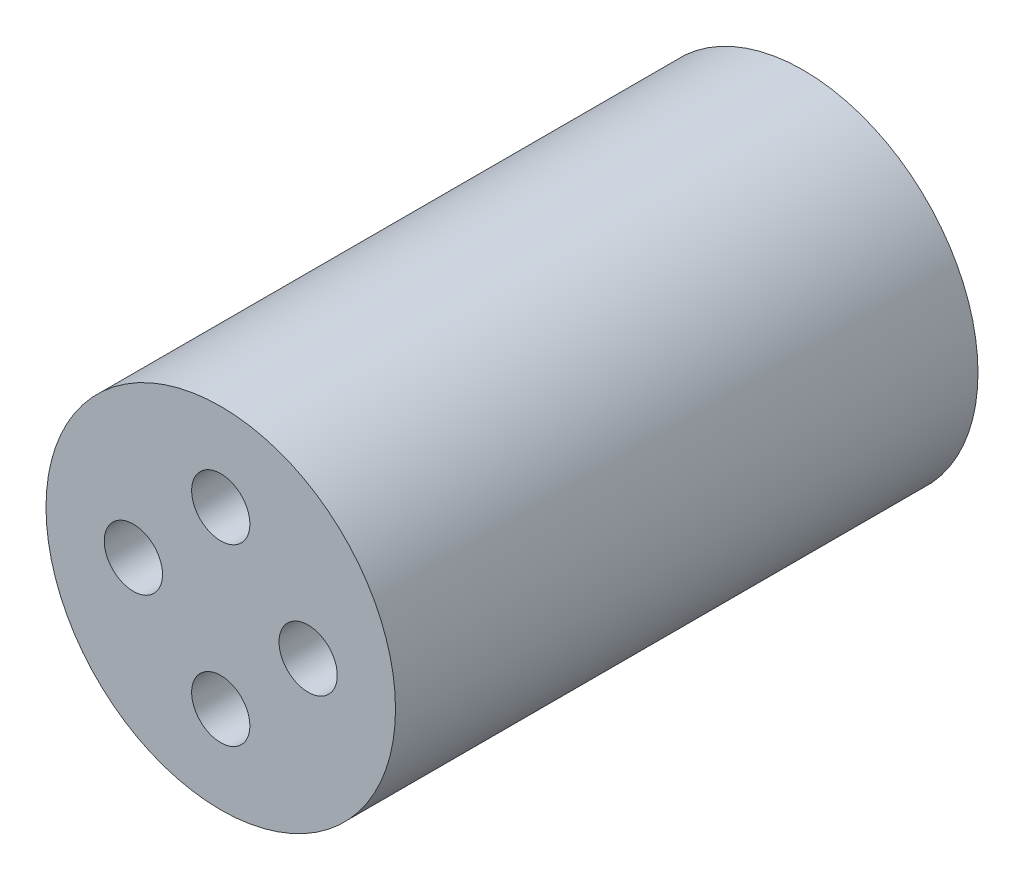
ISO-10303-21;
HEADER;
FILE_DESCRIPTION(('STEP AP214'),'2;1');
FILE_NAME('part.step','',(''),(''),'','','');
FILE_SCHEMA(('AUTOMOTIVE_DESIGN { 1 0 10303 214 1 1 1 1 }'));
ENDSEC;
DATA;
#1=APPLICATION_CONTEXT('core data for automotive mechanical design processes');
#2=APPLICATION_PROTOCOL_DEFINITION('international standard','automotive_design',2000,#1);
#3=PRODUCT_CONTEXT('',#1,'mechanical');
#4=PRODUCT('Part','Part','',(#3));
#5=PRODUCT_RELATED_PRODUCT_CATEGORY('part','',(#4));
#6=PRODUCT_DEFINITION_FORMATION('','',#4);
#7=PRODUCT_DEFINITION_CONTEXT('part definition',#1,'design');
#8=PRODUCT_DEFINITION('design','',#6,#7);
#9=PRODUCT_DEFINITION_SHAPE('','',#8);
#10=(LENGTH_UNIT() NAMED_UNIT(*) SI_UNIT(.MILLI.,.METRE.));
#11=(NAMED_UNIT(*) PLANE_ANGLE_UNIT() SI_UNIT($,.RADIAN.));
#12=(NAMED_UNIT(*) SI_UNIT($,.STERADIAN.) SOLID_ANGLE_UNIT());
#13=UNCERTAINTY_MEASURE_WITH_UNIT(LENGTH_MEASURE(1.E-05),#10,'distance_accuracy_value','');
#14=(GEOMETRIC_REPRESENTATION_CONTEXT(3) GLOBAL_UNCERTAINTY_ASSIGNED_CONTEXT((#13)) GLOBAL_UNIT_ASSIGNED_CONTEXT((#10,
#11,#12)) REPRESENTATION_CONTEXT('',''));
#15=CARTESIAN_POINT('',(0.,0.,0.));
#16=DIRECTION('',(0.,0.,1.));
#17=DIRECTION('',(1.,0.,0.));
#18=AXIS2_PLACEMENT_3D('',#15,#16,#17);
#19=CARTESIAN_POINT('',(0.,0.,20.));
#20=DIRECTION('',(0.,0.,1.));
#21=DIRECTION('',(1.,0.,0.));
#22=AXIS2_PLACEMENT_3D('',#19,#20,#21);
#23=PLANE('',#22);
#24=CARTESIAN_POINT('',(3.95699567787191E-13,-3.,20.));
#25=DIRECTION('',(0.,0.,1.));
#26=DIRECTION('',(1.,0.,0.));
#27=AXIS2_PLACEMENT_3D('',#24,#25,#26);
#28=CIRCLE('',#27,1.);
#29=CARTESIAN_POINT('',(1.0000000000004,-3.,20.));
#30=VERTEX_POINT('',#29);
#31=EDGE_CURVE('E64',#30,#30,#28,.T.);
#32=ORIENTED_EDGE('',*,*,#31,.F.);
#33=EDGE_LOOP('',(#32));
#34=FACE_BOUND('',#33,.T.);
#35=CARTESIAN_POINT('',(0.,3.,20.));
#36=DIRECTION('',(0.,0.,1.));
#37=DIRECTION('',(1.,0.,0.));
#38=AXIS2_PLACEMENT_3D('',#35,#36,#37);
#39=CIRCLE('',#38,1.);
#40=CARTESIAN_POINT('',(1.,3.,20.));
#41=VERTEX_POINT('',#40);
#42=EDGE_CURVE('E50',#41,#41,#39,.T.);
#43=ORIENTED_EDGE('',*,*,#42,.F.);
#44=EDGE_LOOP('',(#43));
#45=FACE_BOUND('',#44,.T.);
#46=CARTESIAN_POINT('',(0.,0.,20.));
#47=DIRECTION('',(0.,0.,1.));
#48=DIRECTION('',(1.,0.,0.));
#49=AXIS2_PLACEMENT_3D('',#46,#47,#48);
#50=CIRCLE('',#49,6.);
#51=CARTESIAN_POINT('',(6.,0.,20.));
#52=VERTEX_POINT('',#51);
#53=EDGE_CURVE('E10',#52,#52,#50,.T.);
#54=ORIENTED_EDGE('',*,*,#53,.T.);
#55=EDGE_LOOP('',(#54));
#56=FACE_BOUND('',#55,.T.);
#57=CARTESIAN_POINT('',(3.0000000000002,1.97849783893595E-13,20.));
#58=DIRECTION('',(0.,0.,1.));
#59=DIRECTION('',(1.,0.,0.));
#60=AXIS2_PLACEMENT_3D('',#57,#58,#59);
#61=CIRCLE('',#60,1.);
#62=CARTESIAN_POINT('',(4.0000000000002,1.97849783893595E-13,20.));
#63=VERTEX_POINT('',#62);
#64=EDGE_CURVE('E56',#63,#63,#61,.T.);
#65=ORIENTED_EDGE('',*,*,#64,.F.);
#66=EDGE_LOOP('',(#65));
#67=FACE_BOUND('',#66,.T.);
#68=CARTESIAN_POINT('',(-2.9999999999998,-1.9821717793334E-13,20.));
#69=DIRECTION('',(0.,0.,1.));
#70=DIRECTION('',(1.,0.,0.));
#71=AXIS2_PLACEMENT_3D('',#68,#69,#70);
#72=CIRCLE('',#71,1.);
#73=CARTESIAN_POINT('',(-1.9999999999998,-1.9821717793334E-13,20.));
#74=VERTEX_POINT('',#73);
#75=EDGE_CURVE('E72',#74,#74,#72,.T.);
#76=ORIENTED_EDGE('',*,*,#75,.F.);
#77=EDGE_LOOP('',(#76));
#78=FACE_BOUND('',#77,.T.);
#79=ADVANCED_FACE('F37',(#34,#45,#56,#67,#78),#23,.T.);
#80=CARTESIAN_POINT('',(0.,0.,0.));
#81=DIRECTION('',(0.,0.,1.));
#82=DIRECTION('',(1.,0.,0.));
#83=AXIS2_PLACEMENT_3D('',#80,#81,#82);
#84=PLANE('',#83);
#85=CARTESIAN_POINT('',(0.,0.,0.));
#86=DIRECTION('',(0.,0.,1.));
#87=DIRECTION('',(1.,0.,0.));
#88=AXIS2_PLACEMENT_3D('',#85,#86,#87);
#89=CIRCLE('',#88,6.);
#90=CARTESIAN_POINT('',(6.,0.,0.));
#91=VERTEX_POINT('',#90);
#92=EDGE_CURVE('E41',#91,#91,#89,.T.);
#93=ORIENTED_EDGE('',*,*,#92,.F.);
#94=EDGE_LOOP('',(#93));
#95=FACE_BOUND('',#94,.T.);
#96=CARTESIAN_POINT('',(0.,3.,0.));
#97=DIRECTION('',(0.,0.,1.));
#98=DIRECTION('',(1.,0.,0.));
#99=AXIS2_PLACEMENT_3D('',#96,#97,#98);
#100=CIRCLE('',#99,1.);
#101=CARTESIAN_POINT('',(1.,3.,0.));
#102=VERTEX_POINT('',#101);
#103=EDGE_CURVE('E52',#102,#102,#100,.T.);
#104=ORIENTED_EDGE('',*,*,#103,.T.);
#105=EDGE_LOOP('',(#104));
#106=FACE_BOUND('',#105,.T.);
#107=CARTESIAN_POINT('',(3.0000000000002,1.97849783893595E-13,0.));
#108=DIRECTION('',(0.,0.,1.));
#109=DIRECTION('',(1.,0.,0.));
#110=AXIS2_PLACEMENT_3D('',#107,#108,#109);
#111=CIRCLE('',#110,1.);
#112=CARTESIAN_POINT('',(4.0000000000002,1.97849783893595E-13,0.));
#113=VERTEX_POINT('',#112);
#114=EDGE_CURVE('E60',#113,#113,#111,.T.);
#115=ORIENTED_EDGE('',*,*,#114,.T.);
#116=EDGE_LOOP('',(#115));
#117=FACE_BOUND('',#116,.T.);
#118=CARTESIAN_POINT('',(3.95699567787191E-13,-3.,0.));
#119=DIRECTION('',(0.,0.,1.));
#120=DIRECTION('',(1.,0.,0.));
#121=AXIS2_PLACEMENT_3D('',#118,#119,#120);
#122=CIRCLE('',#121,1.);
#123=CARTESIAN_POINT('',(1.0000000000004,-3.,0.));
#124=VERTEX_POINT('',#123);
#125=EDGE_CURVE('E68',#124,#124,#122,.T.);
#126=ORIENTED_EDGE('',*,*,#125,.T.);
#127=EDGE_LOOP('',(#126));
#128=FACE_BOUND('',#127,.T.);
#129=CARTESIAN_POINT('',(-2.9999999999998,-1.9821717793334E-13,0.));
#130=DIRECTION('',(0.,0.,1.));
#131=DIRECTION('',(1.,0.,0.));
#132=AXIS2_PLACEMENT_3D('',#129,#130,#131);
#133=CIRCLE('',#132,1.);
#134=CARTESIAN_POINT('',(-1.9999999999998,-1.9821717793334E-13,0.));
#135=VERTEX_POINT('',#134);
#136=EDGE_CURVE('E76',#135,#135,#133,.T.);
#137=ORIENTED_EDGE('',*,*,#136,.T.);
#138=EDGE_LOOP('',(#137));
#139=FACE_BOUND('',#138,.T.);
#140=ADVANCED_FACE('F88',(#95,#106,#117,#128,#139),#84,.F.);
#141=CARTESIAN_POINT('',(0.,0.,20.));
#142=DIRECTION('',(0.,0.,-1.));
#143=DIRECTION('',(-1.,0.,0.));
#144=AXIS2_PLACEMENT_3D('',#141,#142,#143);
#145=CYLINDRICAL_SURFACE('',#144,6.);
#146=ORIENTED_EDGE('',*,*,#53,.F.);
#147=EDGE_LOOP('',(#146));
#148=FACE_BOUND('',#147,.T.);
#149=ORIENTED_EDGE('',*,*,#92,.T.);
#150=EDGE_LOOP('',(#149));
#151=FACE_BOUND('',#150,.T.);
#152=ADVANCED_FACE('F39',(#148,#151),#145,.T.);
#153=CARTESIAN_POINT('',(0.,3.,20.));
#154=DIRECTION('',(0.,0.,-1.));
#155=DIRECTION('',(-1.,0.,0.));
#156=AXIS2_PLACEMENT_3D('',#153,#154,#155);
#157=CYLINDRICAL_SURFACE('',#156,1.);
#158=ORIENTED_EDGE('',*,*,#42,.T.);
#159=EDGE_LOOP('',(#158));
#160=FACE_BOUND('',#159,.T.);
#161=ORIENTED_EDGE('',*,*,#103,.F.);
#162=EDGE_LOOP('',(#161));
#163=FACE_BOUND('',#162,.T.);
#164=ADVANCED_FACE('F98',(#160,#163),#157,.F.);
#165=CARTESIAN_POINT('',(3.0000000000002,1.97849783893595E-13,20.));
#166=DIRECTION('',(0.,0.,-1.));
#167=DIRECTION('',(-1.,0.,0.));
#168=AXIS2_PLACEMENT_3D('',#165,#166,#167);
#169=CYLINDRICAL_SURFACE('',#168,1.);
#170=ORIENTED_EDGE('',*,*,#64,.T.);
#171=EDGE_LOOP('',(#170));
#172=FACE_BOUND('',#171,.T.);
#173=ORIENTED_EDGE('',*,*,#114,.F.);
#174=EDGE_LOOP('',(#173));
#175=FACE_BOUND('',#174,.T.);
#176=ADVANCED_FACE('F101',(#172,#175),#169,.F.);
#177=CARTESIAN_POINT('',(3.95699567787191E-13,-3.,20.));
#178=DIRECTION('',(0.,0.,-1.));
#179=DIRECTION('',(-1.,0.,0.));
#180=AXIS2_PLACEMENT_3D('',#177,#178,#179);
#181=CYLINDRICAL_SURFACE('',#180,1.);
#182=ORIENTED_EDGE('',*,*,#31,.T.);
#183=EDGE_LOOP('',(#182));
#184=FACE_BOUND('',#183,.T.);
#185=ORIENTED_EDGE('',*,*,#125,.F.);
#186=EDGE_LOOP('',(#185));
#187=FACE_BOUND('',#186,.T.);
#188=ADVANCED_FACE('F105',(#184,#187),#181,.F.);
#189=CARTESIAN_POINT('',(-2.9999999999998,-1.9821717793334E-13,20.));
#190=DIRECTION('',(0.,0.,-1.));
#191=DIRECTION('',(-1.,0.,0.));
#192=AXIS2_PLACEMENT_3D('',#189,#190,#191);
#193=CYLINDRICAL_SURFACE('',#192,1.);
#194=ORIENTED_EDGE('',*,*,#75,.T.);
#195=EDGE_LOOP('',(#194));
#196=FACE_BOUND('',#195,.T.);
#197=ORIENTED_EDGE('',*,*,#136,.F.);
#198=EDGE_LOOP('',(#197));
#199=FACE_BOUND('',#198,.T.);
#200=ADVANCED_FACE('F84',(#196,#199),#193,.F.);
#201=CLOSED_SHELL('',(#79,#140,#152,#164,#176,#188,#200));
#202=MANIFOLD_SOLID_BREP('B2',#201);
#203=ADVANCED_BREP_SHAPE_REPRESENTATION('',(#18,#202),#14);
#204=SHAPE_DEFINITION_REPRESENTATION(#9,#203);
ENDSEC;
END-ISO-10303-21;
